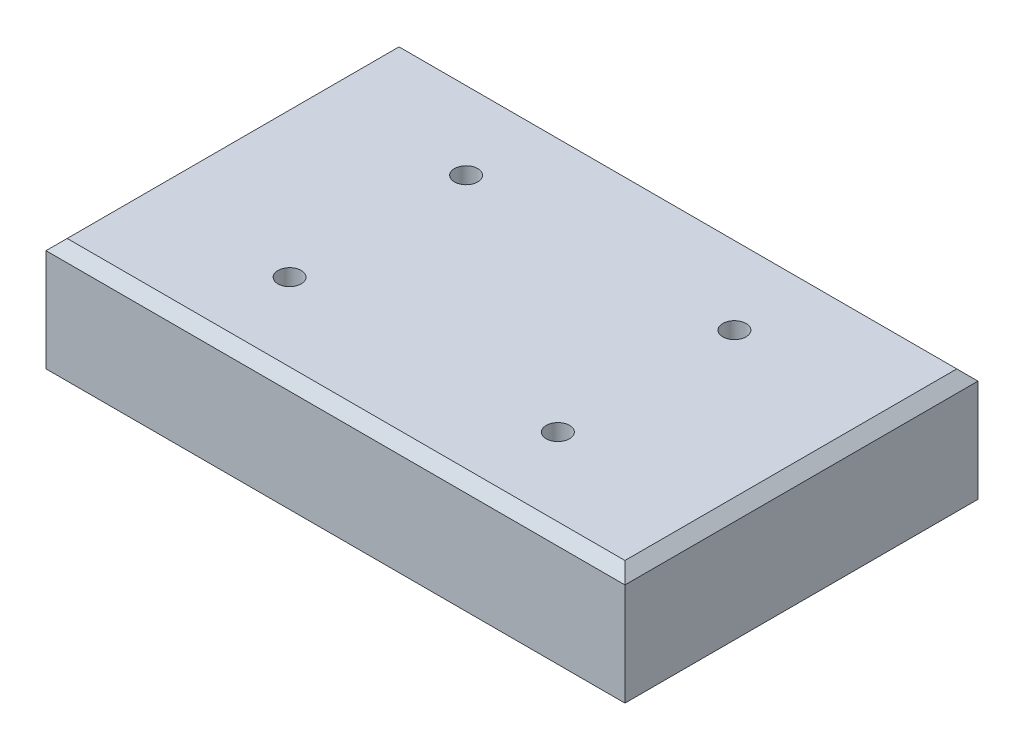
ISO-10303-21;
HEADER;
FILE_DESCRIPTION(('STEP AP214'),'2;1');
FILE_NAME('part.step','',(''),(''),'','','');
FILE_SCHEMA(('AUTOMOTIVE_DESIGN { 1 0 10303 214 1 1 1 1 }'));
ENDSEC;
DATA;
#1=APPLICATION_CONTEXT('core data for automotive mechanical design processes');
#2=APPLICATION_PROTOCOL_DEFINITION('international standard','automotive_design',2000,#1);
#3=PRODUCT_CONTEXT('',#1,'mechanical');
#4=PRODUCT('Part','Part','',(#3));
#5=PRODUCT_RELATED_PRODUCT_CATEGORY('part','',(#4));
#6=PRODUCT_DEFINITION_FORMATION('','',#4);
#7=PRODUCT_DEFINITION_CONTEXT('part definition',#1,'design');
#8=PRODUCT_DEFINITION('design','',#6,#7);
#9=PRODUCT_DEFINITION_SHAPE('','',#8);
#10=(LENGTH_UNIT() NAMED_UNIT(*) SI_UNIT(.MILLI.,.METRE.));
#11=(NAMED_UNIT(*) PLANE_ANGLE_UNIT() SI_UNIT($,.RADIAN.));
#12=(NAMED_UNIT(*) SI_UNIT($,.STERADIAN.) SOLID_ANGLE_UNIT());
#13=UNCERTAINTY_MEASURE_WITH_UNIT(LENGTH_MEASURE(1.E-05),#10,'distance_accuracy_value','');
#14=(GEOMETRIC_REPRESENTATION_CONTEXT(3) GLOBAL_UNCERTAINTY_ASSIGNED_CONTEXT((#13)) GLOBAL_UNIT_ASSIGNED_CONTEXT((#10,
#11,#12)) REPRESENTATION_CONTEXT('',''));
#15=CARTESIAN_POINT('',(0.,0.,0.));
#16=DIRECTION('',(0.,0.,1.));
#17=DIRECTION('',(1.,0.,0.));
#18=AXIS2_PLACEMENT_3D('',#15,#16,#17);
#19=CARTESIAN_POINT('',(-41.,16.,25.));
#20=DIRECTION('',(1.,0.,0.));
#21=DIRECTION('',(0.,0.,-1.));
#22=AXIS2_PLACEMENT_3D('',#19,#20,#21);
#23=PLANE('',#22);
#24=DIRECTION('',(0.,-1.,0.));
#25=VECTOR('',#24,1.);
#26=CARTESIAN_POINT('',(-41.,16.,25.));
#27=LINE('',#26,#25);
#28=CARTESIAN_POINT('',(-41.,14.5,25.));
#29=VERTEX_POINT('',#28);
#30=CARTESIAN_POINT('',(-41.,0.,25.));
#31=VERTEX_POINT('',#30);
#32=EDGE_CURVE('E151',#29,#31,#27,.T.);
#33=ORIENTED_EDGE('',*,*,#32,.F.);
#34=DIRECTION('',(0.,0.,-1.));
#35=VECTOR('',#34,1.);
#36=CARTESIAN_POINT('',(-41.,14.5,-25.));
#37=LINE('',#36,#35);
#38=CARTESIAN_POINT('',(-41.,14.5,-25.));
#39=VERTEX_POINT('',#38);
#40=EDGE_CURVE('E162',#29,#39,#37,.T.);
#41=ORIENTED_EDGE('',*,*,#40,.T.);
#42=DIRECTION('',(0.,-1.,0.));
#43=VECTOR('',#42,1.);
#44=CARTESIAN_POINT('',(-41.,16.,-25.));
#45=LINE('',#44,#43);
#46=CARTESIAN_POINT('',(-41.,0.,-25.));
#47=VERTEX_POINT('',#46);
#48=EDGE_CURVE('E145',#39,#47,#45,.T.);
#49=ORIENTED_EDGE('',*,*,#48,.T.);
#50=DIRECTION('',(0.,0.,1.));
#51=VECTOR('',#50,1.);
#52=CARTESIAN_POINT('',(-41.,0.,25.));
#53=LINE('',#52,#51);
#54=EDGE_CURVE('E133',#47,#31,#53,.T.);
#55=ORIENTED_EDGE('',*,*,#54,.T.);
#56=EDGE_LOOP('',(#33,#41,#49,#55));
#57=FACE_BOUND('',#56,.T.);
#58=ADVANCED_FACE('F35',(#57),#23,.F.);
#59=CARTESIAN_POINT('',(41.,16.,25.));
#60=DIRECTION('',(0.,0.,-1.));
#61=DIRECTION('',(-1.,0.,0.));
#62=AXIS2_PLACEMENT_3D('',#59,#60,#61);
#63=PLANE('',#62);
#64=DIRECTION('',(0.,-1.,0.));
#65=VECTOR('',#64,1.);
#66=CARTESIAN_POINT('',(41.,16.,25.));
#67=LINE('',#66,#65);
#68=CARTESIAN_POINT('',(41.,14.5,25.));
#69=VERTEX_POINT('',#68);
#70=CARTESIAN_POINT('',(41.,0.,25.));
#71=VERTEX_POINT('',#70);
#72=EDGE_CURVE('E149',#69,#71,#67,.T.);
#73=ORIENTED_EDGE('',*,*,#72,.F.);
#74=DIRECTION('',(-1.,0.,0.));
#75=VECTOR('',#74,1.);
#76=CARTESIAN_POINT('',(-41.,14.5,25.));
#77=LINE('',#76,#75);
#78=EDGE_CURVE('E165',#69,#29,#77,.T.);
#79=ORIENTED_EDGE('',*,*,#78,.T.);
#80=ORIENTED_EDGE('',*,*,#32,.T.);
#81=DIRECTION('',(1.,0.,0.));
#82=VECTOR('',#81,1.);
#83=CARTESIAN_POINT('',(41.,0.,25.));
#84=LINE('',#83,#82);
#85=EDGE_CURVE('E136',#31,#71,#84,.T.);
#86=ORIENTED_EDGE('',*,*,#85,.T.);
#87=EDGE_LOOP('',(#73,#79,#80,#86));
#88=FACE_BOUND('',#87,.T.);
#89=ADVANCED_FACE('F188',(#88),#63,.F.);
#90=CARTESIAN_POINT('',(41.,16.,25.));
#91=DIRECTION('',(-1.,0.,0.));
#92=DIRECTION('',(0.,0.,1.));
#93=AXIS2_PLACEMENT_3D('',#90,#91,#92);
#94=PLANE('',#93);
#95=DIRECTION('',(0.,-1.,0.));
#96=VECTOR('',#95,1.);
#97=CARTESIAN_POINT('',(41.,16.,-25.));
#98=LINE('',#97,#96);
#99=CARTESIAN_POINT('',(41.,14.5,-25.));
#100=VERTEX_POINT('',#99);
#101=CARTESIAN_POINT('',(41.,0.,-25.));
#102=VERTEX_POINT('',#101);
#103=EDGE_CURVE('E147',#100,#102,#98,.T.);
#104=ORIENTED_EDGE('',*,*,#103,.F.);
#105=DIRECTION('',(0.,0.,1.));
#106=VECTOR('',#105,1.);
#107=CARTESIAN_POINT('',(41.,14.5,25.));
#108=LINE('',#107,#106);
#109=EDGE_CURVE('E11',#100,#69,#108,.T.);
#110=ORIENTED_EDGE('',*,*,#109,.T.);
#111=ORIENTED_EDGE('',*,*,#72,.T.);
#112=DIRECTION('',(0.,0.,-1.));
#113=VECTOR('',#112,1.);
#114=CARTESIAN_POINT('',(41.,0.,25.));
#115=LINE('',#114,#113);
#116=EDGE_CURVE('E139',#71,#102,#115,.T.);
#117=ORIENTED_EDGE('',*,*,#116,.T.);
#118=EDGE_LOOP('',(#104,#110,#111,#117));
#119=FACE_BOUND('',#118,.T.);
#120=ADVANCED_FACE('F209',(#119),#94,.F.);
#121=CARTESIAN_POINT('',(41.,16.,-25.));
#122=DIRECTION('',(0.,0.,1.));
#123=DIRECTION('',(1.,0.,0.));
#124=AXIS2_PLACEMENT_3D('',#121,#122,#123);
#125=PLANE('',#124);
#126=ORIENTED_EDGE('',*,*,#48,.F.);
#127=DIRECTION('',(1.,0.,0.));
#128=VECTOR('',#127,1.);
#129=CARTESIAN_POINT('',(41.,14.5,-25.));
#130=LINE('',#129,#128);
#131=EDGE_CURVE('E45',#39,#100,#130,.T.);
#132=ORIENTED_EDGE('',*,*,#131,.T.);
#133=ORIENTED_EDGE('',*,*,#103,.T.);
#134=DIRECTION('',(-1.,0.,0.));
#135=VECTOR('',#134,1.);
#136=CARTESIAN_POINT('',(41.,0.,-25.));
#137=LINE('',#136,#135);
#138=EDGE_CURVE('E142',#102,#47,#137,.T.);
#139=ORIENTED_EDGE('',*,*,#138,.T.);
#140=EDGE_LOOP('',(#126,#132,#133,#139));
#141=FACE_BOUND('',#140,.T.);
#142=ADVANCED_FACE('F200',(#141),#125,.F.);
#143=CARTESIAN_POINT('',(0.,16.,0.));
#144=DIRECTION('',(0.,1.,0.));
#145=DIRECTION('',(0.,0.,1.));
#146=AXIS2_PLACEMENT_3D('',#143,#144,#145);
#147=PLANE('',#146);
#148=CARTESIAN_POINT('',(-19.,16.,-12.5));
#149=DIRECTION('',(0.,1.,0.));
#150=DIRECTION('',(0.,0.,1.));
#151=AXIS2_PLACEMENT_3D('',#148,#149,#150);
#152=CIRCLE('',#151,1.64999999999999);
#153=CARTESIAN_POINT('',(-19.,16.,-10.85));
#154=VERTEX_POINT('',#153);
#155=EDGE_CURVE('E110',#154,#154,#152,.T.);
#156=ORIENTED_EDGE('',*,*,#155,.F.);
#157=EDGE_LOOP('',(#156));
#158=FACE_BOUND('',#157,.T.);
#159=CARTESIAN_POINT('',(19.,16.,-12.5));
#160=DIRECTION('',(0.,1.,0.));
#161=DIRECTION('',(0.,0.,1.));
#162=AXIS2_PLACEMENT_3D('',#159,#160,#161);
#163=CIRCLE('',#162,1.64999999999999);
#164=CARTESIAN_POINT('',(19.,16.,-10.85));
#165=VERTEX_POINT('',#164);
#166=EDGE_CURVE('E109',#165,#165,#163,.T.);
#167=ORIENTED_EDGE('',*,*,#166,.F.);
#168=EDGE_LOOP('',(#167));
#169=FACE_BOUND('',#168,.T.);
#170=CARTESIAN_POINT('',(19.,16.,12.5));
#171=DIRECTION('',(0.,1.,0.));
#172=DIRECTION('',(0.,0.,1.));
#173=AXIS2_PLACEMENT_3D('',#170,#171,#172);
#174=CIRCLE('',#173,1.64999999999999);
#175=CARTESIAN_POINT('',(19.,16.,14.15));
#176=VERTEX_POINT('',#175);
#177=EDGE_CURVE('E120',#176,#176,#174,.T.);
#178=ORIENTED_EDGE('',*,*,#177,.F.);
#179=EDGE_LOOP('',(#178));
#180=FACE_BOUND('',#179,.T.);
#181=CARTESIAN_POINT('',(-19.,16.,12.5));
#182=DIRECTION('',(0.,1.,0.));
#183=DIRECTION('',(0.,0.,1.));
#184=AXIS2_PLACEMENT_3D('',#181,#182,#183);
#185=CIRCLE('',#184,1.64999999999999);
#186=CARTESIAN_POINT('',(-19.,16.,14.15));
#187=VERTEX_POINT('',#186);
#188=EDGE_CURVE('E126',#187,#187,#185,.T.);
#189=ORIENTED_EDGE('',*,*,#188,.F.);
#190=EDGE_LOOP('',(#189));
#191=FACE_BOUND('',#190,.T.);
#192=DIRECTION('',(-1.,0.,0.));
#193=VECTOR('',#192,1.);
#194=CARTESIAN_POINT('',(-41.,16.,-23.5));
#195=LINE('',#194,#193);
#196=CARTESIAN_POINT('',(39.5,16.,-23.5));
#197=VERTEX_POINT('',#196);
#198=CARTESIAN_POINT('',(-39.5,16.,-23.5));
#199=VERTEX_POINT('',#198);
#200=EDGE_CURVE('E155',#197,#199,#195,.T.);
#201=ORIENTED_EDGE('',*,*,#200,.T.);
#202=DIRECTION('',(0.,0.,1.));
#203=VECTOR('',#202,1.);
#204=CARTESIAN_POINT('',(-39.5,16.,25.));
#205=LINE('',#204,#203);
#206=CARTESIAN_POINT('',(-39.5,16.,23.5));
#207=VERTEX_POINT('',#206);
#208=EDGE_CURVE('E159',#199,#207,#205,.T.);
#209=ORIENTED_EDGE('',*,*,#208,.T.);
#210=DIRECTION('',(1.,0.,0.));
#211=VECTOR('',#210,1.);
#212=CARTESIAN_POINT('',(41.,16.,23.5));
#213=LINE('',#212,#211);
#214=CARTESIAN_POINT('',(39.5,16.,23.5));
#215=VERTEX_POINT('',#214);
#216=EDGE_CURVE('E157',#207,#215,#213,.T.);
#217=ORIENTED_EDGE('',*,*,#216,.T.);
#218=DIRECTION('',(0.,0.,-1.));
#219=VECTOR('',#218,1.);
#220=CARTESIAN_POINT('',(39.5,16.,-25.));
#221=LINE('',#220,#219);
#222=EDGE_CURVE('E153',#215,#197,#221,.T.);
#223=ORIENTED_EDGE('',*,*,#222,.T.);
#224=EDGE_LOOP('',(#201,#209,#217,#223));
#225=FACE_BOUND('',#224,.T.);
#226=ADVANCED_FACE('F197',(#158,#169,#180,#191,#225),#147,.T.);
#227=CARTESIAN_POINT('',(0.,0.,0.));
#228=DIRECTION('',(0.,1.,0.));
#229=DIRECTION('',(0.,0.,1.));
#230=AXIS2_PLACEMENT_3D('',#227,#228,#229);
#231=PLANE('',#230);
#232=ORIENTED_EDGE('',*,*,#54,.F.);
#233=ORIENTED_EDGE('',*,*,#138,.F.);
#234=ORIENTED_EDGE('',*,*,#116,.F.);
#235=ORIENTED_EDGE('',*,*,#85,.F.);
#236=EDGE_LOOP('',(#232,#233,#234,#235));
#237=FACE_BOUND('',#236,.T.);
#238=ADVANCED_FACE('F199',(#237),#231,.F.);
#239=CARTESIAN_POINT('',(39.5,16.,0.));
#240=DIRECTION('',(0.707106781186551,0.707106781186544,0.));
#241=DIRECTION('',(0.,0.,1.));
#242=AXIS2_PLACEMENT_3D('',#239,#240,#241);
#243=PLANE('',#242);
#244=DIRECTION('',(0.577350269189624,-0.577350269189629,0.577350269189624));
#245=VECTOR('',#244,1.);
#246=CARTESIAN_POINT('',(31.6666666666667,23.8333333333334,15.6666666666667));
#247=LINE('',#246,#245);
#248=EDGE_CURVE('E170',#69,#215,#247,.F.);
#249=ORIENTED_EDGE('',*,*,#248,.F.);
#250=ORIENTED_EDGE('',*,*,#109,.F.);
#251=DIRECTION('',(-0.577350269189624,0.577350269189629,0.577350269189624));
#252=VECTOR('',#251,1.);
#253=CARTESIAN_POINT('',(31.6666666666667,23.8333333333334,-15.6666666666667));
#254=LINE('',#253,#252);
#255=EDGE_CURVE('E40',#197,#100,#254,.F.);
#256=ORIENTED_EDGE('',*,*,#255,.F.);
#257=ORIENTED_EDGE('',*,*,#222,.F.);
#258=EDGE_LOOP('',(#249,#250,#256,#257));
#259=FACE_BOUND('',#258,.T.);
#260=ADVANCED_FACE('F38',(#259),#243,.T.);
#261=CARTESIAN_POINT('',(0.,16.,-23.5));
#262=DIRECTION('',(0.,0.707106781186544,-0.707106781186551));
#263=DIRECTION('',(1.,0.,0.));
#264=AXIS2_PLACEMENT_3D('',#261,#262,#263);
#265=PLANE('',#264);
#266=ORIENTED_EDGE('',*,*,#255,.T.);
#267=ORIENTED_EDGE('',*,*,#131,.F.);
#268=DIRECTION('',(0.577350269189624,0.577350269189629,0.577350269189624));
#269=VECTOR('',#268,1.);
#270=CARTESIAN_POINT('',(-26.3333333333334,29.1666666666667,-10.3333333333334));
#271=LINE('',#270,#269);
#272=EDGE_CURVE('E169',#199,#39,#271,.F.);
#273=ORIENTED_EDGE('',*,*,#272,.F.);
#274=ORIENTED_EDGE('',*,*,#200,.F.);
#275=EDGE_LOOP('',(#266,#267,#273,#274));
#276=FACE_BOUND('',#275,.T.);
#277=ADVANCED_FACE('F180',(#276),#265,.T.);
#278=CARTESIAN_POINT('',(0.,16.,23.5));
#279=DIRECTION('',(0.,0.707106781186544,0.707106781186551));
#280=DIRECTION('',(-1.,0.,0.));
#281=AXIS2_PLACEMENT_3D('',#278,#279,#280);
#282=PLANE('',#281);
#283=ORIENTED_EDGE('',*,*,#248,.T.);
#284=ORIENTED_EDGE('',*,*,#216,.F.);
#285=DIRECTION('',(-0.577350269189624,-0.577350269189629,0.577350269189624));
#286=VECTOR('',#285,1.);
#287=CARTESIAN_POINT('',(-26.3333333333334,29.1666666666667,10.3333333333334));
#288=LINE('',#287,#286);
#289=EDGE_CURVE('E132',#29,#207,#288,.F.);
#290=ORIENTED_EDGE('',*,*,#289,.F.);
#291=ORIENTED_EDGE('',*,*,#78,.F.);
#292=EDGE_LOOP('',(#283,#284,#290,#291));
#293=FACE_BOUND('',#292,.T.);
#294=ADVANCED_FACE('F185',(#293),#282,.T.);
#295=CARTESIAN_POINT('',(-39.5,16.,0.));
#296=DIRECTION('',(-0.707106781186551,0.707106781186544,0.));
#297=DIRECTION('',(0.,0.,-1.));
#298=AXIS2_PLACEMENT_3D('',#295,#296,#297);
#299=PLANE('',#298);
#300=ORIENTED_EDGE('',*,*,#272,.T.);
#301=ORIENTED_EDGE('',*,*,#40,.F.);
#302=ORIENTED_EDGE('',*,*,#289,.T.);
#303=ORIENTED_EDGE('',*,*,#208,.F.);
#304=EDGE_LOOP('',(#300,#301,#302,#303));
#305=FACE_BOUND('',#304,.T.);
#306=ADVANCED_FACE('F194',(#305),#299,.T.);
#307=CARTESIAN_POINT('',(-19.,10.,12.5));
#308=DIRECTION('',(0.,1.,0.));
#309=DIRECTION('',(0.,0.,1.));
#310=AXIS2_PLACEMENT_3D('',#307,#308,#309);
#311=CONICAL_SURFACE('',#310,1.65,1.02974425867665);
#312=CARTESIAN_POINT('',(-19.,9.00857997860453,12.5));
#313=VERTEX_POINT('',#312);
#314=VERTEX_LOOP('',#313);
#315=FACE_BOUND('',#314,.T.);
#316=CARTESIAN_POINT('',(-19.,10.,12.5));
#317=DIRECTION('',(0.,1.,0.));
#318=DIRECTION('',(0.,0.,1.));
#319=AXIS2_PLACEMENT_3D('',#316,#317,#318);
#320=CIRCLE('',#319,1.65);
#321=CARTESIAN_POINT('',(-19.,10.,14.15));
#322=VERTEX_POINT('',#321);
#323=EDGE_CURVE('E129',#322,#322,#320,.T.);
#324=ORIENTED_EDGE('',*,*,#323,.T.);
#325=EDGE_LOOP('',(#324));
#326=FACE_BOUND('',#325,.T.);
#327=ADVANCED_FACE('F228',(#315,#326),#311,.F.);
#328=CARTESIAN_POINT('',(-19.,16.,12.5));
#329=DIRECTION('',(0.,1.,0.));
#330=DIRECTION('',(0.,0.,1.));
#331=AXIS2_PLACEMENT_3D('',#328,#329,#330);
#332=CYLINDRICAL_SURFACE('',#331,1.65);
#333=ORIENTED_EDGE('',*,*,#323,.F.);
#334=EDGE_LOOP('',(#333));
#335=FACE_BOUND('',#334,.T.);
#336=ORIENTED_EDGE('',*,*,#188,.T.);
#337=EDGE_LOOP('',(#336));
#338=FACE_BOUND('',#337,.T.);
#339=ADVANCED_FACE('F285',(#335,#338),#332,.F.);
#340=CARTESIAN_POINT('',(19.,10.,12.5));
#341=DIRECTION('',(0.,1.,0.));
#342=DIRECTION('',(0.,0.,1.));
#343=AXIS2_PLACEMENT_3D('',#340,#341,#342);
#344=CONICAL_SURFACE('',#343,1.65,1.02974425867665);
#345=CARTESIAN_POINT('',(19.,9.00857997860453,12.5));
#346=VERTEX_POINT('',#345);
#347=VERTEX_LOOP('',#346);
#348=FACE_BOUND('',#347,.T.);
#349=CARTESIAN_POINT('',(19.,10.,12.5));
#350=DIRECTION('',(0.,1.,0.));
#351=DIRECTION('',(0.,0.,1.));
#352=AXIS2_PLACEMENT_3D('',#349,#350,#351);
#353=CIRCLE('',#352,1.65);
#354=CARTESIAN_POINT('',(19.,10.,14.15));
#355=VERTEX_POINT('',#354);
#356=EDGE_CURVE('E123',#355,#355,#353,.T.);
#357=ORIENTED_EDGE('',*,*,#356,.T.);
#358=EDGE_LOOP('',(#357));
#359=FACE_BOUND('',#358,.T.);
#360=ADVANCED_FACE('F294',(#348,#359),#344,.F.);
#361=CARTESIAN_POINT('',(19.,16.,12.5));
#362=DIRECTION('',(0.,1.,0.));
#363=DIRECTION('',(0.,0.,1.));
#364=AXIS2_PLACEMENT_3D('',#361,#362,#363);
#365=CYLINDRICAL_SURFACE('',#364,1.65);
#366=ORIENTED_EDGE('',*,*,#356,.F.);
#367=EDGE_LOOP('',(#366));
#368=FACE_BOUND('',#367,.T.);
#369=ORIENTED_EDGE('',*,*,#177,.T.);
#370=EDGE_LOOP('',(#369));
#371=FACE_BOUND('',#370,.T.);
#372=ADVANCED_FACE('F304',(#368,#371),#365,.F.);
#373=CARTESIAN_POINT('',(19.,10.,-12.5));
#374=DIRECTION('',(0.,1.,0.));
#375=DIRECTION('',(0.,0.,1.));
#376=AXIS2_PLACEMENT_3D('',#373,#374,#375);
#377=CONICAL_SURFACE('',#376,1.65,1.02974425867665);
#378=CARTESIAN_POINT('',(19.,9.00857997860453,-12.5));
#379=VERTEX_POINT('',#378);
#380=VERTEX_LOOP('',#379);
#381=FACE_BOUND('',#380,.T.);
#382=CARTESIAN_POINT('',(19.,10.,-12.5));
#383=DIRECTION('',(0.,1.,0.));
#384=DIRECTION('',(0.,0.,1.));
#385=AXIS2_PLACEMENT_3D('',#382,#383,#384);
#386=CIRCLE('',#385,1.65);
#387=CARTESIAN_POINT('',(19.,10.,-10.85));
#388=VERTEX_POINT('',#387);
#389=EDGE_CURVE('E113',#388,#388,#386,.T.);
#390=ORIENTED_EDGE('',*,*,#389,.T.);
#391=EDGE_LOOP('',(#390));
#392=FACE_BOUND('',#391,.T.);
#393=ADVANCED_FACE('F314',(#381,#392),#377,.F.);
#394=CARTESIAN_POINT('',(19.,16.,-12.5));
#395=DIRECTION('',(0.,1.,0.));
#396=DIRECTION('',(0.,0.,1.));
#397=AXIS2_PLACEMENT_3D('',#394,#395,#396);
#398=CYLINDRICAL_SURFACE('',#397,1.65);
#399=ORIENTED_EDGE('',*,*,#389,.F.);
#400=EDGE_LOOP('',(#399));
#401=FACE_BOUND('',#400,.T.);
#402=ORIENTED_EDGE('',*,*,#166,.T.);
#403=EDGE_LOOP('',(#402));
#404=FACE_BOUND('',#403,.T.);
#405=ADVANCED_FACE('F103',(#401,#404),#398,.F.);
#406=CARTESIAN_POINT('',(-19.,10.,-12.5));
#407=DIRECTION('',(0.,1.,0.));
#408=DIRECTION('',(0.,0.,1.));
#409=AXIS2_PLACEMENT_3D('',#406,#407,#408);
#410=CONICAL_SURFACE('',#409,1.65,1.02974425867665);
#411=CARTESIAN_POINT('',(-19.,9.00857997860453,-12.5));
#412=VERTEX_POINT('',#411);
#413=VERTEX_LOOP('',#412);
#414=FACE_BOUND('',#413,.T.);
#415=CARTESIAN_POINT('',(-19.,10.,-12.5));
#416=DIRECTION('',(0.,1.,0.));
#417=DIRECTION('',(0.,0.,1.));
#418=AXIS2_PLACEMENT_3D('',#415,#416,#417);
#419=CIRCLE('',#418,1.65);
#420=CARTESIAN_POINT('',(-19.,10.,-10.85));
#421=VERTEX_POINT('',#420);
#422=EDGE_CURVE('E107',#421,#421,#419,.T.);
#423=ORIENTED_EDGE('',*,*,#422,.T.);
#424=EDGE_LOOP('',(#423));
#425=FACE_BOUND('',#424,.T.);
#426=ADVANCED_FACE('F99',(#414,#425),#410,.F.);
#427=CARTESIAN_POINT('',(-19.,16.,-12.5));
#428=DIRECTION('',(0.,1.,0.));
#429=DIRECTION('',(0.,0.,1.));
#430=AXIS2_PLACEMENT_3D('',#427,#428,#429);
#431=CYLINDRICAL_SURFACE('',#430,1.65);
#432=ORIENTED_EDGE('',*,*,#422,.F.);
#433=EDGE_LOOP('',(#432));
#434=FACE_BOUND('',#433,.T.);
#435=ORIENTED_EDGE('',*,*,#155,.T.);
#436=EDGE_LOOP('',(#435));
#437=FACE_BOUND('',#436,.T.);
#438=ADVANCED_FACE('F102',(#434,#437),#431,.F.);
#439=CLOSED_SHELL('',(#58,#89,#120,#142,#226,#238,#260,#277,#294,#306,#327,#339,#360,#372,#393,
#405,#426,#438));
#440=MANIFOLD_SOLID_BREP('B2',#439);
#441=ADVANCED_BREP_SHAPE_REPRESENTATION('',(#18,#440),#14);
#442=SHAPE_DEFINITION_REPRESENTATION(#9,#441);
ENDSEC;
END-ISO-10303-21;
